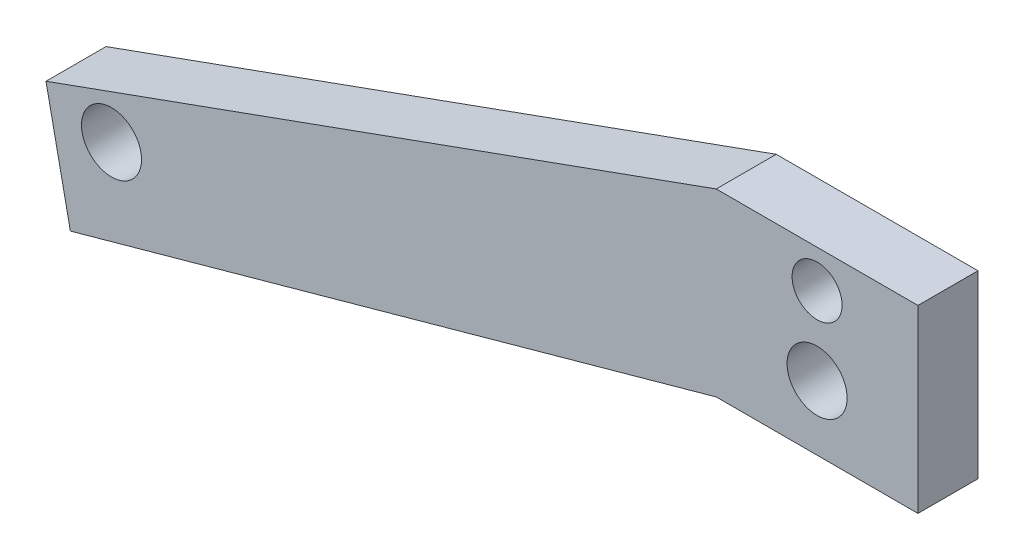
ISO-10303-21;
HEADER;
FILE_DESCRIPTION(('STEP AP214'),'2;1');
FILE_NAME('part.step','',(''),(''),'','','');
FILE_SCHEMA(('AUTOMOTIVE_DESIGN { 1 0 10303 214 1 1 1 1 }'));
ENDSEC;
DATA;
#1=APPLICATION_CONTEXT('core data for automotive mechanical design processes');
#2=APPLICATION_PROTOCOL_DEFINITION('international standard','automotive_design',2000,#1);
#3=PRODUCT_CONTEXT('',#1,'mechanical');
#4=PRODUCT('Part','Part','',(#3));
#5=PRODUCT_RELATED_PRODUCT_CATEGORY('part','',(#4));
#6=PRODUCT_DEFINITION_FORMATION('','',#4);
#7=PRODUCT_DEFINITION_CONTEXT('part definition',#1,'design');
#8=PRODUCT_DEFINITION('design','',#6,#7);
#9=PRODUCT_DEFINITION_SHAPE('','',#8);
#10=(LENGTH_UNIT() NAMED_UNIT(*) SI_UNIT(.MILLI.,.METRE.));
#11=(NAMED_UNIT(*) PLANE_ANGLE_UNIT() SI_UNIT($,.RADIAN.));
#12=(NAMED_UNIT(*) SI_UNIT($,.STERADIAN.) SOLID_ANGLE_UNIT());
#13=UNCERTAINTY_MEASURE_WITH_UNIT(LENGTH_MEASURE(1.E-05),#10,'distance_accuracy_value','');
#14=(GEOMETRIC_REPRESENTATION_CONTEXT(3) GLOBAL_UNCERTAINTY_ASSIGNED_CONTEXT((#13)) GLOBAL_UNIT_ASSIGNED_CONTEXT((#10,
#11,#12)) REPRESENTATION_CONTEXT('',''));
#15=CARTESIAN_POINT('',(0.,0.,0.));
#16=DIRECTION('',(0.,0.,1.));
#17=DIRECTION('',(1.,0.,0.));
#18=AXIS2_PLACEMENT_3D('',#15,#16,#17);
#19=CARTESIAN_POINT('',(-115.953067928368,-24.0314320839182,9.525));
#20=DIRECTION('',(-0.97919143062245,-0.202938764644804,0.));
#21=DIRECTION('',(0.202938764644804,-0.97919143062245,0.));
#22=AXIS2_PLACEMENT_3D('',#19,#20,#21);
#23=PLANE('',#22);
#24=DIRECTION('',(-0.202938764644804,0.97919143062245,0.));
#25=VECTOR('',#24,1.);
#26=CARTESIAN_POINT('',(-115.953067928368,-24.0314320839182,0.));
#27=LINE('',#26,#25);
#28=CARTESIAN_POINT('',(-118.444110918553,-12.0120036934371,0.));
#29=VERTEX_POINT('',#28);
#30=CARTESIAN_POINT('',(-122.310094385036,6.64159305992054,0.));
#31=VERTEX_POINT('',#30);
#32=EDGE_CURVE('E130',#29,#31,#27,.T.);
#33=ORIENTED_EDGE('',*,*,#32,.F.);
#34=DIRECTION('',(0.,0.,-1.));
#35=VECTOR('',#34,1.);
#36=CARTESIAN_POINT('',(-118.444110918553,-12.0120036934371,9.525));
#37=LINE('',#36,#35);
#38=CARTESIAN_POINT('',(-118.444110918553,-12.0120036934371,9.525));
#39=VERTEX_POINT('',#38);
#40=EDGE_CURVE('E11',#39,#29,#37,.T.);
#41=ORIENTED_EDGE('',*,*,#40,.F.);
#42=DIRECTION('',(-0.202938764644804,0.97919143062245,0.));
#43=VECTOR('',#42,1.);
#44=CARTESIAN_POINT('',(-115.953067928368,-24.0314320839182,9.525));
#45=LINE('',#44,#43);
#46=CARTESIAN_POINT('',(-122.310094385036,6.64159305992054,9.525));
#47=VERTEX_POINT('',#46);
#48=EDGE_CURVE('E254',#39,#47,#45,.T.);
#49=ORIENTED_EDGE('',*,*,#48,.T.);
#50=DIRECTION('',(0.,0.,-1.));
#51=VECTOR('',#50,1.);
#52=CARTESIAN_POINT('',(-122.310094385036,6.64159305992054,9.525));
#53=LINE('',#52,#51);
#54=EDGE_CURVE('E80',#47,#31,#53,.T.);
#55=ORIENTED_EDGE('',*,*,#54,.T.);
#56=EDGE_LOOP('',(#33,#41,#49,#55));
#57=FACE_BOUND('',#56,.T.);
#58=ADVANCED_FACE('F35',(#57),#23,.T.);
#59=CARTESIAN_POINT('',(-5.37781857577428,19.37355814627,9.525));
#60=DIRECTION('',(0.267471847407683,-0.963565675418298,0.));
#61=DIRECTION('',(0.963565675418298,0.267471847407683,0.));
#62=AXIS2_PLACEMENT_3D('',#59,#60,#61);
#63=PLANE('',#62);
#64=DIRECTION('',(-0.963565675418298,-0.267471847407683,0.));
#65=VECTOR('',#64,1.);
#66=CARTESIAN_POINT('',(-5.37781857577428,19.37355814627,0.));
#67=LINE('',#66,#65);
#68=CARTESIAN_POINT('',(-15.99998830612,16.4249979871297,0.));
#69=VERTEX_POINT('',#68);
#70=EDGE_CURVE('E128',#69,#29,#67,.T.);
#71=ORIENTED_EDGE('',*,*,#70,.F.);
#72=DIRECTION('',(0.,0.,-1.));
#73=VECTOR('',#72,1.);
#74=CARTESIAN_POINT('',(-15.99998830612,16.4249979871297,9.525));
#75=LINE('',#74,#73);
#76=CARTESIAN_POINT('',(-15.99998830612,16.4249979871297,9.525));
#77=VERTEX_POINT('',#76);
#78=EDGE_CURVE('E44',#77,#69,#75,.T.);
#79=ORIENTED_EDGE('',*,*,#78,.F.);
#80=DIRECTION('',(-0.963565675418298,-0.267471847407683,0.));
#81=VECTOR('',#80,1.);
#82=CARTESIAN_POINT('',(-5.37781857577428,19.37355814627,9.525));
#83=LINE('',#82,#81);
#84=EDGE_CURVE('E255',#77,#39,#83,.T.);
#85=ORIENTED_EDGE('',*,*,#84,.T.);
#86=ORIENTED_EDGE('',*,*,#40,.T.);
#87=EDGE_LOOP('',(#71,#79,#85,#86));
#88=FACE_BOUND('',#87,.T.);
#89=ADVANCED_FACE('F129',(#88),#63,.T.);
#90=CARTESIAN_POINT('',(0.,16.4249979871297,9.525));
#91=DIRECTION('',(0.,-1.,0.));
#92=DIRECTION('',(1.,0.,0.));
#93=AXIS2_PLACEMENT_3D('',#90,#91,#92);
#94=PLANE('',#93);
#95=DIRECTION('',(-1.,0.,0.));
#96=VECTOR('',#95,1.);
#97=CARTESIAN_POINT('',(0.,16.4249979871297,0.));
#98=LINE('',#97,#96);
#99=CARTESIAN_POINT('',(16.0000114542561,16.4249979871297,0.));
#100=VERTEX_POINT('',#99);
#101=EDGE_CURVE('E124',#100,#69,#98,.T.);
#102=ORIENTED_EDGE('',*,*,#101,.F.);
#103=DIRECTION('',(0.,0.,-1.));
#104=VECTOR('',#103,1.);
#105=CARTESIAN_POINT('',(16.0000114542561,16.4249979871297,9.525));
#106=LINE('',#105,#104);
#107=CARTESIAN_POINT('',(16.0000114542561,16.4249979871297,9.525));
#108=VERTEX_POINT('',#107);
#109=EDGE_CURVE('E114',#108,#100,#106,.T.);
#110=ORIENTED_EDGE('',*,*,#109,.F.);
#111=DIRECTION('',(-1.,0.,0.));
#112=VECTOR('',#111,1.);
#113=CARTESIAN_POINT('',(0.,16.4249979871297,9.525));
#114=LINE('',#113,#112);
#115=EDGE_CURVE('E108',#108,#77,#114,.T.);
#116=ORIENTED_EDGE('',*,*,#115,.T.);
#117=ORIENTED_EDGE('',*,*,#78,.T.);
#118=EDGE_LOOP('',(#102,#110,#116,#117));
#119=FACE_BOUND('',#118,.T.);
#120=ADVANCED_FACE('F122',(#119),#94,.T.);
#121=CARTESIAN_POINT('',(16.0000114542561,0.,9.525));
#122=DIRECTION('',(-1.,0.,0.));
#123=DIRECTION('',(0.,-1.,0.));
#124=AXIS2_PLACEMENT_3D('',#121,#122,#123);
#125=PLANE('',#124);
#126=DIRECTION('',(0.,1.,0.));
#127=VECTOR('',#126,1.);
#128=CARTESIAN_POINT('',(16.0000114542561,0.,0.));
#129=LINE('',#128,#127);
#130=CARTESIAN_POINT('',(16.0000114542561,44.9999979871298,0.));
#131=VERTEX_POINT('',#130);
#132=EDGE_CURVE('E113',#100,#131,#129,.T.);
#133=ORIENTED_EDGE('',*,*,#132,.T.);
#134=DIRECTION('',(0.,0.,-1.));
#135=VECTOR('',#134,1.);
#136=CARTESIAN_POINT('',(16.0000114542561,44.9999979871298,9.525));
#137=LINE('',#136,#135);
#138=CARTESIAN_POINT('',(16.0000114542561,44.9999979871298,9.525));
#139=VERTEX_POINT('',#138);
#140=EDGE_CURVE('E98',#139,#131,#137,.T.);
#141=ORIENTED_EDGE('',*,*,#140,.F.);
#142=DIRECTION('',(0.,1.,0.));
#143=VECTOR('',#142,1.);
#144=CARTESIAN_POINT('',(16.0000114542561,0.,9.525));
#145=LINE('',#144,#143);
#146=EDGE_CURVE('E101',#108,#139,#145,.T.);
#147=ORIENTED_EDGE('',*,*,#146,.F.);
#148=ORIENTED_EDGE('',*,*,#109,.T.);
#149=EDGE_LOOP('',(#133,#141,#147,#148));
#150=FACE_BOUND('',#149,.T.);
#151=ADVANCED_FACE('F111',(#150),#125,.F.);
#152=CARTESIAN_POINT('',(0.,44.9999979871298,9.525));
#153=DIRECTION('',(0.,-1.,0.));
#154=DIRECTION('',(1.,0.,0.));
#155=AXIS2_PLACEMENT_3D('',#152,#153,#154);
#156=PLANE('',#155);
#157=DIRECTION('',(-1.,0.,0.));
#158=VECTOR('',#157,1.);
#159=CARTESIAN_POINT('',(0.,44.9999979871298,0.));
#160=LINE('',#159,#158);
#161=CARTESIAN_POINT('',(-15.999988545744,44.9999979871298,0.));
#162=VERTEX_POINT('',#161);
#163=EDGE_CURVE('E134',#131,#162,#160,.T.);
#164=ORIENTED_EDGE('',*,*,#163,.T.);
#165=DIRECTION('',(0.,0.,-1.));
#166=VECTOR('',#165,1.);
#167=CARTESIAN_POINT('',(-15.999988545744,44.9999979871298,9.525));
#168=LINE('',#167,#166);
#169=CARTESIAN_POINT('',(-15.999988545744,44.9999979871298,9.525));
#170=VERTEX_POINT('',#169);
#171=EDGE_CURVE('E100',#170,#162,#168,.T.);
#172=ORIENTED_EDGE('',*,*,#171,.F.);
#173=DIRECTION('',(-1.,0.,0.));
#174=VECTOR('',#173,1.);
#175=CARTESIAN_POINT('',(0.,44.9999979871298,9.525));
#176=LINE('',#175,#174);
#177=EDGE_CURVE('E93',#139,#170,#176,.T.);
#178=ORIENTED_EDGE('',*,*,#177,.F.);
#179=ORIENTED_EDGE('',*,*,#140,.T.);
#180=EDGE_LOOP('',(#164,#172,#178,#179));
#181=FACE_BOUND('',#180,.T.);
#182=ADVANCED_FACE('F96',(#181),#156,.F.);
#183=CARTESIAN_POINT('',(1.14542556793596E-05,38.9999979871299,9.525));
#184=DIRECTION('',(0.,0.,-1.));
#185=DIRECTION('',(-1.,0.,0.));
#186=AXIS2_PLACEMENT_3D('',#183,#184,#185);
#187=CYLINDRICAL_SURFACE('',#186,3.96875000000001);
#188=CARTESIAN_POINT('',(1.14542556793596E-05,38.9999979871299,9.525));
#189=DIRECTION('',(0.,0.,1.));
#190=DIRECTION('',(1.,0.,0.));
#191=AXIS2_PLACEMENT_3D('',#188,#189,#190);
#192=CIRCLE('',#191,3.96875000000001);
#193=CARTESIAN_POINT('',(3.96876145425569,38.9999979871299,9.525));
#194=VERTEX_POINT('',#193);
#195=EDGE_CURVE('E256',#194,#194,#192,.T.);
#196=ORIENTED_EDGE('',*,*,#195,.T.);
#197=EDGE_LOOP('',(#196));
#198=FACE_BOUND('',#197,.T.);
#199=CARTESIAN_POINT('',(1.14542556793596E-05,38.9999979871299,0.));
#200=DIRECTION('',(0.,0.,1.));
#201=DIRECTION('',(1.,0.,0.));
#202=AXIS2_PLACEMENT_3D('',#199,#200,#201);
#203=CIRCLE('',#202,3.96875000000001);
#204=CARTESIAN_POINT('',(3.96876145425569,38.9999979871299,0.));
#205=VERTEX_POINT('',#204);
#206=EDGE_CURVE('E148',#205,#205,#203,.T.);
#207=ORIENTED_EDGE('',*,*,#206,.F.);
#208=EDGE_LOOP('',(#207));
#209=FACE_BOUND('',#208,.T.);
#210=ADVANCED_FACE('F158',(#198,#209),#187,.F.);
#211=CARTESIAN_POINT('',(1.09421601926854E-05,26.6475933535848,9.525));
#212=DIRECTION('',(0.,0.,-1.));
#213=DIRECTION('',(-1.,0.,0.));
#214=AXIS2_PLACEMENT_3D('',#211,#212,#213);
#215=CYLINDRICAL_SURFACE('',#214,4.76250000164186);
#216=CARTESIAN_POINT('',(1.09421601926854E-05,26.6475933535848,9.525));
#217=DIRECTION('',(0.,0.,1.));
#218=DIRECTION('',(1.,0.,0.));
#219=AXIS2_PLACEMENT_3D('',#216,#217,#218);
#220=CIRCLE('',#219,4.76250000164186);
#221=CARTESIAN_POINT('',(4.76251094380205,26.6475933535848,9.525));
#222=VERTEX_POINT('',#221);
#223=EDGE_CURVE('E172',#222,#222,#220,.T.);
#224=ORIENTED_EDGE('',*,*,#223,.T.);
#225=EDGE_LOOP('',(#224));
#226=FACE_BOUND('',#225,.T.);
#227=CARTESIAN_POINT('',(1.09421601926854E-05,26.6475933535848,0.));
#228=DIRECTION('',(0.,0.,1.));
#229=DIRECTION('',(1.,0.,0.));
#230=AXIS2_PLACEMENT_3D('',#227,#228,#229);
#231=CIRCLE('',#230,4.76250000164186);
#232=CARTESIAN_POINT('',(4.76251094380205,26.6475933535848,0.));
#233=VERTEX_POINT('',#232);
#234=EDGE_CURVE('E145',#233,#233,#231,.T.);
#235=ORIENTED_EDGE('',*,*,#234,.F.);
#236=EDGE_LOOP('',(#235));
#237=FACE_BOUND('',#236,.T.);
#238=ADVANCED_FACE('F160',(#226,#237),#215,.F.);
#239=CARTESIAN_POINT('',(-111.921569577986,3.45169255468377,9.525));
#240=DIRECTION('',(0.,0.,-1.));
#241=DIRECTION('',(-1.,0.,0.));
#242=AXIS2_PLACEMENT_3D('',#239,#240,#241);
#243=CYLINDRICAL_SURFACE('',#242,4.76250000164186);
#244=CARTESIAN_POINT('',(-111.921569577986,3.45169255468377,9.525));
#245=DIRECTION('',(0.,0.,1.));
#246=DIRECTION('',(1.,0.,0.));
#247=AXIS2_PLACEMENT_3D('',#244,#245,#246);
#248=CIRCLE('',#247,4.76250000164186);
#249=CARTESIAN_POINT('',(-107.159069576344,3.45169255468377,9.525));
#250=VERTEX_POINT('',#249);
#251=EDGE_CURVE('E139',#250,#250,#248,.T.);
#252=ORIENTED_EDGE('',*,*,#251,.T.);
#253=EDGE_LOOP('',(#252));
#254=FACE_BOUND('',#253,.T.);
#255=CARTESIAN_POINT('',(-111.921569577986,3.45169255468377,0.));
#256=DIRECTION('',(0.,0.,1.));
#257=DIRECTION('',(1.,0.,0.));
#258=AXIS2_PLACEMENT_3D('',#255,#256,#257);
#259=CIRCLE('',#258,4.76250000164186);
#260=CARTESIAN_POINT('',(-107.159069576344,3.45169255468377,0.));
#261=VERTEX_POINT('',#260);
#262=EDGE_CURVE('E142',#261,#261,#259,.T.);
#263=ORIENTED_EDGE('',*,*,#262,.F.);
#264=EDGE_LOOP('',(#263));
#265=FACE_BOUND('',#264,.T.);
#266=ADVANCED_FACE('F37',(#254,#265),#243,.F.);
#267=CARTESIAN_POINT('',(-16.2094565186077,44.9244185560028,9.525));
#268=DIRECTION('',(0.339399020117958,-0.940642495926572,0.));
#269=DIRECTION('',(0.940642495926572,0.339399020117958,0.));
#270=AXIS2_PLACEMENT_3D('',#267,#268,#269);
#271=PLANE('',#270);
#272=DIRECTION('',(-0.940642495926572,-0.339399020117958,0.));
#273=VECTOR('',#272,1.);
#274=CARTESIAN_POINT('',(-16.2094565186077,44.9244185560028,0.));
#275=LINE('',#274,#273);
#276=EDGE_CURVE('E73',#162,#31,#275,.T.);
#277=ORIENTED_EDGE('',*,*,#276,.T.);
#278=ORIENTED_EDGE('',*,*,#54,.F.);
#279=DIRECTION('',(-0.940642495926572,-0.339399020117958,0.));
#280=VECTOR('',#279,1.);
#281=CARTESIAN_POINT('',(-16.2094565186077,44.9244185560028,9.525));
#282=LINE('',#281,#280);
#283=EDGE_CURVE('E52',#170,#47,#282,.T.);
#284=ORIENTED_EDGE('',*,*,#283,.F.);
#285=ORIENTED_EDGE('',*,*,#171,.T.);
#286=EDGE_LOOP('',(#277,#278,#284,#285));
#287=FACE_BOUND('',#286,.T.);
#288=ADVANCED_FACE('F167',(#287),#271,.F.);
#289=CARTESIAN_POINT('',(0.,0.,9.525));
#290=DIRECTION('',(0.,0.,1.));
#291=DIRECTION('',(1.,0.,0.));
#292=AXIS2_PLACEMENT_3D('',#289,#290,#291);
#293=PLANE('',#292);
#294=ORIENTED_EDGE('',*,*,#251,.F.);
#295=EDGE_LOOP('',(#294));
#296=FACE_BOUND('',#295,.T.);
#297=ORIENTED_EDGE('',*,*,#223,.F.);
#298=EDGE_LOOP('',(#297));
#299=FACE_BOUND('',#298,.T.);
#300=ORIENTED_EDGE('',*,*,#195,.F.);
#301=EDGE_LOOP('',(#300));
#302=FACE_BOUND('',#301,.T.);
#303=ORIENTED_EDGE('',*,*,#48,.F.);
#304=ORIENTED_EDGE('',*,*,#84,.F.);
#305=ORIENTED_EDGE('',*,*,#115,.F.);
#306=ORIENTED_EDGE('',*,*,#146,.T.);
#307=ORIENTED_EDGE('',*,*,#177,.T.);
#308=ORIENTED_EDGE('',*,*,#283,.T.);
#309=EDGE_LOOP('',(#303,#304,#305,#306,#307,#308));
#310=FACE_BOUND('',#309,.T.);
#311=ADVANCED_FACE('F105',(#296,#299,#302,#310),#293,.T.);
#312=CARTESIAN_POINT('',(0.,0.,0.));
#313=DIRECTION('',(0.,0.,1.));
#314=DIRECTION('',(1.,0.,0.));
#315=AXIS2_PLACEMENT_3D('',#312,#313,#314);
#316=PLANE('',#315);
#317=ORIENTED_EDGE('',*,*,#262,.T.);
#318=EDGE_LOOP('',(#317));
#319=FACE_BOUND('',#318,.T.);
#320=ORIENTED_EDGE('',*,*,#234,.T.);
#321=EDGE_LOOP('',(#320));
#322=FACE_BOUND('',#321,.T.);
#323=ORIENTED_EDGE('',*,*,#206,.T.);
#324=EDGE_LOOP('',(#323));
#325=FACE_BOUND('',#324,.T.);
#326=ORIENTED_EDGE('',*,*,#32,.T.);
#327=ORIENTED_EDGE('',*,*,#276,.F.);
#328=ORIENTED_EDGE('',*,*,#163,.F.);
#329=ORIENTED_EDGE('',*,*,#132,.F.);
#330=ORIENTED_EDGE('',*,*,#101,.T.);
#331=ORIENTED_EDGE('',*,*,#70,.T.);
#332=EDGE_LOOP('',(#326,#327,#328,#329,#330,#331));
#333=FACE_BOUND('',#332,.T.);
#334=ADVANCED_FACE('F132',(#319,#322,#325,#333),#316,.F.);
#335=CLOSED_SHELL('',(#58,#89,#120,#151,#182,#210,#238,#266,#288,#311,#334));
#336=MANIFOLD_SOLID_BREP('B2',#335);
#337=ADVANCED_BREP_SHAPE_REPRESENTATION('',(#18,#336),#14);
#338=SHAPE_DEFINITION_REPRESENTATION(#9,#337);
ENDSEC;
END-ISO-10303-21;
